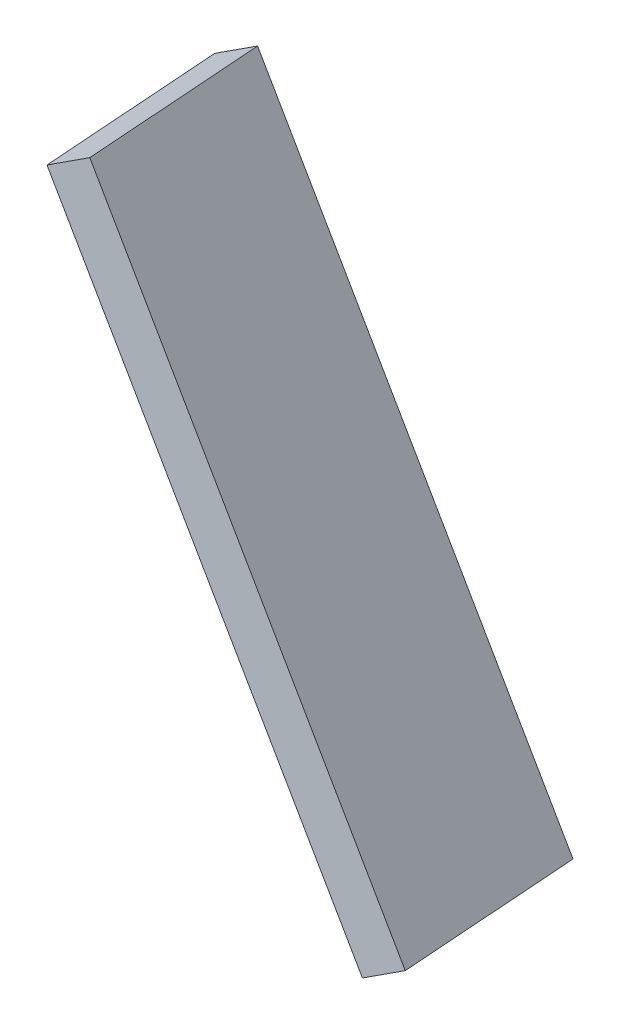
ISO-10303-21;
HEADER;
FILE_DESCRIPTION(('STEP AP214'),'2;1');
FILE_NAME('part.step','',(''),(''),'','','');
FILE_SCHEMA(('AUTOMOTIVE_DESIGN { 1 0 10303 214 1 1 1 1 }'));
ENDSEC;
DATA;
#1=APPLICATION_CONTEXT('core data for automotive mechanical design processes');
#2=APPLICATION_PROTOCOL_DEFINITION('international standard','automotive_design',2000,#1);
#3=PRODUCT_CONTEXT('',#1,'mechanical');
#4=PRODUCT('Part','Part','',(#3));
#5=PRODUCT_RELATED_PRODUCT_CATEGORY('part','',(#4));
#6=PRODUCT_DEFINITION_FORMATION('','',#4);
#7=PRODUCT_DEFINITION_CONTEXT('part definition',#1,'design');
#8=PRODUCT_DEFINITION('design','',#6,#7);
#9=PRODUCT_DEFINITION_SHAPE('','',#8);
#10=(LENGTH_UNIT() NAMED_UNIT(*) SI_UNIT(.MILLI.,.METRE.));
#11=(NAMED_UNIT(*) PLANE_ANGLE_UNIT() SI_UNIT($,.RADIAN.));
#12=(NAMED_UNIT(*) SI_UNIT($,.STERADIAN.) SOLID_ANGLE_UNIT());
#13=UNCERTAINTY_MEASURE_WITH_UNIT(LENGTH_MEASURE(1.E-05),#10,'distance_accuracy_value','');
#14=(GEOMETRIC_REPRESENTATION_CONTEXT(3) GLOBAL_UNCERTAINTY_ASSIGNED_CONTEXT((#13)) GLOBAL_UNIT_ASSIGNED_CONTEXT((#10,
#11,#12)) REPRESENTATION_CONTEXT('',''));
#15=CARTESIAN_POINT('',(0.,0.,0.));
#16=DIRECTION('',(0.,0.,1.));
#17=DIRECTION('',(1.,0.,0.));
#18=AXIS2_PLACEMENT_3D('',#15,#16,#17);
#19=CARTESIAN_POINT('',(7.91573553320099,5.04370297896146,2.29071728664709));
#20=DIRECTION('',(0.852868531952444,0.492403876506103,-0.17364817766693));
#21=DIRECTION('',(0.,-0.332579245006703,-0.943075312894348));
#22=AXIS2_PLACEMENT_3D('',#19,#20,#21);
#23=PLANE('',#22);
#24=DIRECTION('',(-0.5,0.866025403784439,0.));
#25=VECTOR('',#24,1.);
#26=CARTESIAN_POINT('',(8.62901519078178,3.69463208231672,1.96849124598979));
#27=LINE('',#26,#25);
#28=CARTESIAN_POINT('',(8.62901519078178,3.69463208231672,1.96849124598979));
#29=VERTEX_POINT('',#28);
#30=CARTESIAN_POINT('',(7.59596840633131,5.48392159958058,1.96849124598979));
#31=VERTEX_POINT('',#30);
#32=EDGE_CURVE('E78',#29,#31,#27,.T.);
#33=ORIENTED_EDGE('',*,*,#32,.F.);
#34=DIRECTION('',(-0.150383733180435,-0.0868240888334648,-0.984807753012208));
#35=VECTOR('',#34,1.);
#36=CARTESIAN_POINT('',(8.72804601119014,3.75180755313755,2.61700766237839));
#37=LINE('',#36,#35);
#38=CARTESIAN_POINT('',(8.72804601119014,3.75180755313755,2.61700766237839));
#39=VERTEX_POINT('',#38);
#40=EDGE_CURVE('E24',#39,#29,#37,.T.);
#41=ORIENTED_EDGE('',*,*,#40,.F.);
#42=DIRECTION('',(0.5,-0.866025403784439,0.));
#43=VECTOR('',#42,1.);
#44=CARTESIAN_POINT('',(7.69499922673967,5.54109707040141,2.61700766237839));
#45=LINE('',#44,#43);
#46=CARTESIAN_POINT('',(7.69499922673967,5.54109707040141,2.61700766237839));
#47=VERTEX_POINT('',#46);
#48=EDGE_CURVE('E106',#47,#39,#45,.T.);
#49=ORIENTED_EDGE('',*,*,#48,.F.);
#50=DIRECTION('',(0.150383733180435,0.0868240888334648,0.984807753012208));
#51=VECTOR('',#50,1.);
#52=CARTESIAN_POINT('',(7.59596840633131,5.48392159958058,1.96849124598979));
#53=LINE('',#52,#51);
#54=EDGE_CURVE('E82',#31,#47,#53,.T.);
#55=ORIENTED_EDGE('',*,*,#54,.F.);
#56=EDGE_LOOP('',(#33,#41,#49,#55));
#57=FACE_BOUND('',#56,.T.);
#58=ADVANCED_FACE('F16',(#57),#23,.F.);
#59=CARTESIAN_POINT('',(8.03227950637118,5.1109896732437,2.26698836735789));
#60=DIRECTION('',(0.852868531952444,0.492403876506103,-0.17364817766693));
#61=DIRECTION('',(0.,-0.332579245006703,-0.943075312894348));
#62=AXIS2_PLACEMENT_3D('',#59,#60,#61);
#63=PLANE('',#62);
#64=DIRECTION('',(-0.5,0.866025403784439,0.));
#65=VECTOR('',#64,1.);
#66=CARTESIAN_POINT('',(8.74555916395195,3.76191877659895,1.94476232670049));
#67=LINE('',#66,#65);
#68=CARTESIAN_POINT('',(8.74555916395195,3.76191877659895,1.94476232670049));
#69=VERTEX_POINT('',#68);
#70=CARTESIAN_POINT('',(7.71251237950149,5.55120829386281,1.94476232670049));
#71=VERTEX_POINT('',#70);
#72=EDGE_CURVE('E80',#69,#71,#67,.T.);
#73=ORIENTED_EDGE('',*,*,#72,.T.);
#74=DIRECTION('',(0.150383733180435,0.0868240888334648,0.984807753012208));
#75=VECTOR('',#74,1.);
#76=CARTESIAN_POINT('',(7.71251237950149,5.55120829386281,1.94476232670049));
#77=LINE('',#76,#75);
#78=CARTESIAN_POINT('',(7.81154319990985,5.60838376468364,2.59327874308909));
#79=VERTEX_POINT('',#78);
#80=EDGE_CURVE('E103',#71,#79,#77,.T.);
#81=ORIENTED_EDGE('',*,*,#80,.T.);
#82=DIRECTION('',(0.5,-0.866025403784439,0.));
#83=VECTOR('',#82,1.);
#84=CARTESIAN_POINT('',(7.81154319990985,5.60838376468364,2.59327874308909));
#85=LINE('',#84,#83);
#86=CARTESIAN_POINT('',(8.84458998436031,3.81909424741978,2.59327874308909));
#87=VERTEX_POINT('',#86);
#88=EDGE_CURVE('E72',#79,#87,#85,.T.);
#89=ORIENTED_EDGE('',*,*,#88,.T.);
#90=DIRECTION('',(-0.150383733180435,-0.0868240888334648,-0.984807753012208));
#91=VECTOR('',#90,1.);
#92=CARTESIAN_POINT('',(8.84458998436031,3.81909424741978,2.59327874308909));
#93=LINE('',#92,#91);
#94=EDGE_CURVE('E11',#87,#69,#93,.T.);
#95=ORIENTED_EDGE('',*,*,#94,.T.);
#96=EDGE_LOOP('',(#73,#81,#89,#95));
#97=FACE_BOUND('',#96,.T.);
#98=ADVANCED_FACE('F117',(#97),#63,.T.);
#99=CARTESIAN_POINT('',(8.87017604031889,3.83386636371497,2.58806929775909));
#100=DIRECTION('',(-0.5,0.866025403784439,0.));
#101=DIRECTION('',(0.,0.,1.));
#102=AXIS2_PLACEMENT_3D('',#99,#100,#101);
#103=PLANE('',#102);
#104=ORIENTED_EDGE('',*,*,#40,.T.);
#105=DIRECTION('',(-0.852868531952444,-0.492403876506103,0.17364817766693));
#106=VECTOR('',#105,1.);
#107=CARTESIAN_POINT('',(8.77114521991053,3.77669089289413,1.93955288137049));
#108=LINE('',#107,#106);
#109=EDGE_CURVE('E66',#69,#29,#108,.T.);
#110=ORIENTED_EDGE('',*,*,#109,.F.);
#111=ORIENTED_EDGE('',*,*,#94,.F.);
#112=DIRECTION('',(-0.852868531952444,-0.492403876506103,0.17364817766693));
#113=VECTOR('',#112,1.);
#114=CARTESIAN_POINT('',(8.87017604031889,3.83386636371497,2.58806929775909));
#115=LINE('',#114,#113);
#116=EDGE_CURVE('E69',#87,#39,#115,.T.);
#117=ORIENTED_EDGE('',*,*,#116,.T.);
#118=EDGE_LOOP('',(#104,#110,#111,#117));
#119=FACE_BOUND('',#118,.T.);
#120=ADVANCED_FACE('F65',(#119),#103,.F.);
#121=CARTESIAN_POINT('',(7.83712925586843,5.62315588097883,2.58806929775909));
#122=DIRECTION('',(-0.150383733180435,-0.0868240888334648,-0.984807753012208));
#123=DIRECTION('',(-0.988540820816138,0.,0.150953786239881));
#124=AXIS2_PLACEMENT_3D('',#121,#122,#123);
#125=PLANE('',#124);
#126=ORIENTED_EDGE('',*,*,#48,.T.);
#127=ORIENTED_EDGE('',*,*,#116,.F.);
#128=ORIENTED_EDGE('',*,*,#88,.F.);
#129=DIRECTION('',(-0.852868531952444,-0.492403876506103,0.17364817766693));
#130=VECTOR('',#129,1.);
#131=CARTESIAN_POINT('',(7.83712925586843,5.62315588097883,2.58806929775909));
#132=LINE('',#131,#130);
#133=EDGE_CURVE('E98',#79,#47,#132,.T.);
#134=ORIENTED_EDGE('',*,*,#133,.T.);
#135=EDGE_LOOP('',(#126,#127,#128,#134));
#136=FACE_BOUND('',#135,.T.);
#137=ADVANCED_FACE('F112',(#136),#125,.F.);
#138=CARTESIAN_POINT('',(7.73809843546007,5.56598041015799,1.93955288137049));
#139=DIRECTION('',(0.5,-0.866025403784439,0.));
#140=DIRECTION('',(0.,0.,-1.));
#141=AXIS2_PLACEMENT_3D('',#138,#139,#140);
#142=PLANE('',#141);
#143=ORIENTED_EDGE('',*,*,#54,.T.);
#144=ORIENTED_EDGE('',*,*,#133,.F.);
#145=ORIENTED_EDGE('',*,*,#80,.F.);
#146=DIRECTION('',(-0.852868531952444,-0.492403876506103,0.17364817766693));
#147=VECTOR('',#146,1.);
#148=CARTESIAN_POINT('',(7.73809843546007,5.56598041015799,1.93955288137049));
#149=LINE('',#148,#147);
#150=EDGE_CURVE('E87',#71,#31,#149,.T.);
#151=ORIENTED_EDGE('',*,*,#150,.T.);
#152=EDGE_LOOP('',(#143,#144,#145,#151));
#153=FACE_BOUND('',#152,.T.);
#154=ADVANCED_FACE('F115',(#153),#142,.F.);
#155=CARTESIAN_POINT('',(8.77114521991053,3.77669089289413,1.93955288137049));
#156=DIRECTION('',(0.150383733180435,0.0868240888334648,0.984807753012208));
#157=DIRECTION('',(0.5,-0.866025403784439,0.));
#158=AXIS2_PLACEMENT_3D('',#155,#156,#157);
#159=PLANE('',#158);
#160=ORIENTED_EDGE('',*,*,#32,.T.);
#161=ORIENTED_EDGE('',*,*,#150,.F.);
#162=ORIENTED_EDGE('',*,*,#72,.F.);
#163=ORIENTED_EDGE('',*,*,#109,.T.);
#164=EDGE_LOOP('',(#160,#161,#162,#163));
#165=FACE_BOUND('',#164,.T.);
#166=ADVANCED_FACE('F76',(#165),#159,.F.);
#167=CLOSED_SHELL('',(#58,#98,#120,#137,#154,#166));
#168=MANIFOLD_SOLID_BREP('B1',#167);
#169=ADVANCED_BREP_SHAPE_REPRESENTATION('',(#18,#168),#14);
#170=SHAPE_DEFINITION_REPRESENTATION(#9,#169);
ENDSEC;
END-ISO-10303-21;
